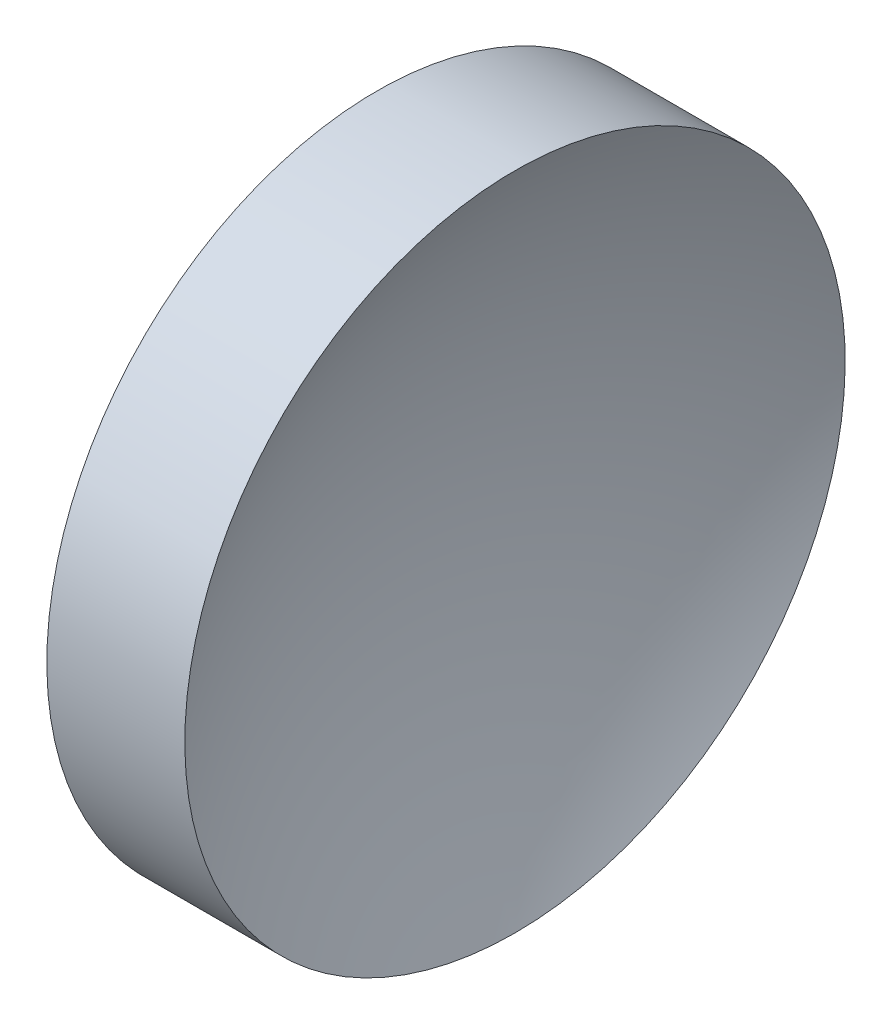
ISO-10303-21;
HEADER;
FILE_DESCRIPTION(('STEP AP214'),'2;1');
FILE_NAME('part.step','',(''),(''),'','','');
FILE_SCHEMA(('AUTOMOTIVE_DESIGN { 1 0 10303 214 1 1 1 1 }'));
ENDSEC;
DATA;
#1=APPLICATION_CONTEXT('core data for automotive mechanical design processes');
#2=APPLICATION_PROTOCOL_DEFINITION('international standard','automotive_design',2000,#1);
#3=PRODUCT_CONTEXT('',#1,'mechanical');
#4=PRODUCT('Part','Part','',(#3));
#5=PRODUCT_RELATED_PRODUCT_CATEGORY('part','',(#4));
#6=PRODUCT_DEFINITION_FORMATION('','',#4);
#7=PRODUCT_DEFINITION_CONTEXT('part definition',#1,'design');
#8=PRODUCT_DEFINITION('design','',#6,#7);
#9=PRODUCT_DEFINITION_SHAPE('','',#8);
#10=(LENGTH_UNIT() NAMED_UNIT(*) SI_UNIT(.MILLI.,.METRE.));
#11=(NAMED_UNIT(*) PLANE_ANGLE_UNIT() SI_UNIT($,.RADIAN.));
#12=(NAMED_UNIT(*) SI_UNIT($,.STERADIAN.) SOLID_ANGLE_UNIT());
#13=UNCERTAINTY_MEASURE_WITH_UNIT(LENGTH_MEASURE(1.E-05),#10,'distance_accuracy_value','');
#14=(GEOMETRIC_REPRESENTATION_CONTEXT(3) GLOBAL_UNCERTAINTY_ASSIGNED_CONTEXT((#13)) GLOBAL_UNIT_ASSIGNED_CONTEXT((#10,
#11,#12)) REPRESENTATION_CONTEXT('',''));
#15=CARTESIAN_POINT('',(0.,0.,0.));
#16=DIRECTION('',(0.,0.,1.));
#17=DIRECTION('',(1.,0.,0.));
#18=AXIS2_PLACEMENT_3D('',#15,#16,#17);
#19=CARTESIAN_POINT('',(85.1981901580211,32.5787747187973,0.));
#20=DIRECTION('',(0.,0.,-1.));
#21=DIRECTION('',(0.,-1.,0.));
#22=AXIS2_PLACEMENT_3D('',#19,#20,#21);
#23=CIRCLE('',#22,25.84);
#24=TRIMMED_CURVE('',#23,(PARAMETER_VALUE(-1.57079443803699)),
(PARAMETER_VALUE(1.57079443803699)),.T.,.PARAMETER.);
#25=CARTESIAN_POINT('',(85.1981901580211,32.5787259132931,0.));
#26=DIRECTION('',(-1.,0.,0.));
#27=AXIS1_PLACEMENT('',#25,#26);
#28=SURFACE_OF_REVOLUTION('',#24,#27);
#29=CARTESIAN_POINT('',(62.5828329894949,32.5787259132931,0.));
#30=DIRECTION('',(-1.,0.,0.));
#31=DIRECTION('',(0.,-1.,0.));
#32=AXIS2_PLACEMENT_3D('',#29,#30,#31);
#33=CIRCLE('',#32,12.5);
#34=CARTESIAN_POINT('',(62.5828329894949,20.0787259132931,0.));
#35=VERTEX_POINT('',#34);
#36=EDGE_CURVE('E11',#35,#35,#33,.T.);
#37=ORIENTED_EDGE('',*,*,#36,.F.);
#38=EDGE_LOOP('',(#37));
#39=FACE_BOUND('',#38,.T.);
#40=CARTESIAN_POINT('',(59.3581901580672,32.5787259132931,0.));
#41=VERTEX_POINT('',#40);
#42=VERTEX_LOOP('',#41);
#43=FACE_BOUND('',#42,.T.);
#44=ADVANCED_FACE('F37',(#39,#43),#28,.F.);
#45=CARTESIAN_POINT('',(55.0073946244212,32.5787259132931,0.));
#46=DIRECTION('',(-1.,0.,0.));
#47=DIRECTION('',(0.,-1.,0.));
#48=AXIS2_PLACEMENT_3D('',#45,#46,#47);
#49=CYLINDRICAL_SURFACE('',#48,12.5);
#50=CARTESIAN_POINT('',(57.3581901580211,32.5787259132931,0.));
#51=DIRECTION('',(-1.,0.,0.));
#52=DIRECTION('',(0.,-1.,0.));
#53=AXIS2_PLACEMENT_3D('',#50,#51,#52);
#54=CIRCLE('',#53,12.5);
#55=CARTESIAN_POINT('',(57.3581901580211,20.0787259132931,0.));
#56=VERTEX_POINT('',#55);
#57=EDGE_CURVE('E43',#56,#56,#54,.T.);
#58=ORIENTED_EDGE('',*,*,#57,.F.);
#59=EDGE_LOOP('',(#58));
#60=FACE_BOUND('',#59,.T.);
#61=ORIENTED_EDGE('',*,*,#36,.T.);
#62=EDGE_LOOP('',(#61));
#63=FACE_BOUND('',#62,.T.);
#64=ADVANCED_FACE('F47',(#60,#63),#49,.T.);
#65=CARTESIAN_POINT('',(57.3581901580211,32.5787259132931,0.));
#66=DIRECTION('',(1.,0.,0.));
#67=DIRECTION('',(0.,1.,0.));
#68=AXIS2_PLACEMENT_3D('',#65,#66,#67);
#69=PLANE('',#68);
#70=ORIENTED_EDGE('',*,*,#57,.T.);
#71=EDGE_LOOP('',(#70));
#72=FACE_BOUND('',#71,.T.);
#73=ADVANCED_FACE('F52',(#72),#69,.F.);
#74=CLOSED_SHELL('',(#44,#64,#73));
#75=MANIFOLD_SOLID_BREP('B2',#74);
#76=ADVANCED_BREP_SHAPE_REPRESENTATION('',(#18,#75),#14);
#77=SHAPE_DEFINITION_REPRESENTATION(#9,#76);
ENDSEC;
END-ISO-10303-21;
